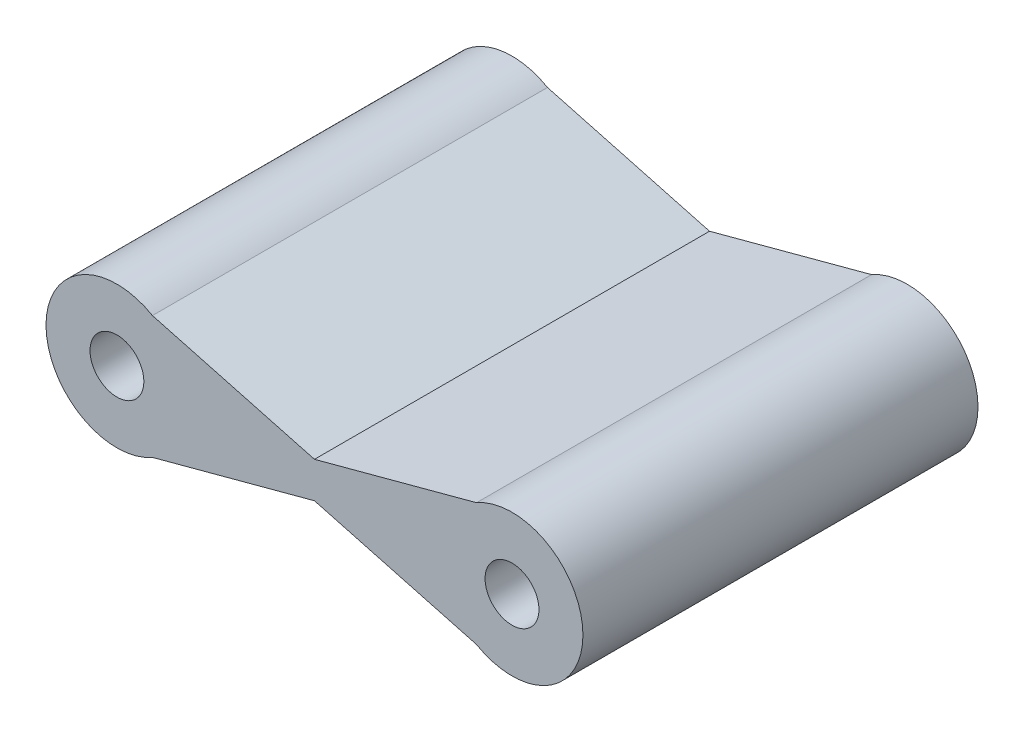
ISO-10303-21;
HEADER;
FILE_DESCRIPTION(('STEP AP214'),'2;1');
FILE_NAME('part.step','',(''),(''),'','','');
FILE_SCHEMA(('AUTOMOTIVE_DESIGN { 1 0 10303 214 1 1 1 1 }'));
ENDSEC;
DATA;
#1=APPLICATION_CONTEXT('core data for automotive mechanical design processes');
#2=APPLICATION_PROTOCOL_DEFINITION('international standard','automotive_design',2000,#1);
#3=PRODUCT_CONTEXT('',#1,'mechanical');
#4=PRODUCT('Part','Part','',(#3));
#5=PRODUCT_RELATED_PRODUCT_CATEGORY('part','',(#4));
#6=PRODUCT_DEFINITION_FORMATION('','',#4);
#7=PRODUCT_DEFINITION_CONTEXT('part definition',#1,'design');
#8=PRODUCT_DEFINITION('design','',#6,#7);
#9=PRODUCT_DEFINITION_SHAPE('','',#8);
#10=(LENGTH_UNIT() NAMED_UNIT(*) SI_UNIT(.MILLI.,.METRE.));
#11=(NAMED_UNIT(*) PLANE_ANGLE_UNIT() SI_UNIT($,.RADIAN.));
#12=(NAMED_UNIT(*) SI_UNIT($,.STERADIAN.) SOLID_ANGLE_UNIT());
#13=UNCERTAINTY_MEASURE_WITH_UNIT(LENGTH_MEASURE(1.E-05),#10,'distance_accuracy_value','');
#14=(GEOMETRIC_REPRESENTATION_CONTEXT(3) GLOBAL_UNCERTAINTY_ASSIGNED_CONTEXT((#13)) GLOBAL_UNIT_ASSIGNED_CONTEXT((#10,
#11,#12)) REPRESENTATION_CONTEXT('',''));
#15=CARTESIAN_POINT('',(0.,0.,0.));
#16=DIRECTION('',(0.,0.,1.));
#17=DIRECTION('',(1.,0.,0.));
#18=AXIS2_PLACEMENT_3D('',#15,#16,#17);
#19=CARTESIAN_POINT('',(0.36902719685434,1.37603361538906,11.));
#20=DIRECTION('',(-0.259028674037289,-0.965869632003452,0.));
#21=DIRECTION('',(0.965869632003452,-0.259028674037289,0.));
#22=AXIS2_PLACEMENT_3D('',#19,#20,#21);
#23=PLANE('',#22);
#24=DIRECTION('',(-0.965869632003452,0.25902867403729,0.));
#25=VECTOR('',#24,1.);
#26=CARTESIAN_POINT('',(0.36902719685434,1.37603361538906,0.));
#27=LINE('',#26,#25);
#28=CARTESIAN_POINT('',(10.0117576762206,-1.20997137680461,0.));
#29=VERTEX_POINT('',#28);
#30=CARTESIAN_POINT('',(5.5,0.,0.));
#31=VERTEX_POINT('',#30);
#32=EDGE_CURVE('E130',#29,#31,#27,.T.);
#33=ORIENTED_EDGE('',*,*,#32,.F.);
#34=DIRECTION('',(0.,0.,-1.));
#35=VECTOR('',#34,1.);
#36=CARTESIAN_POINT('',(10.0117576762206,-1.20997137680461,11.));
#37=LINE('',#36,#35);
#38=CARTESIAN_POINT('',(10.0117576762206,-1.20997137680461,11.));
#39=VERTEX_POINT('',#38);
#40=EDGE_CURVE('E11',#39,#29,#37,.T.);
#41=ORIENTED_EDGE('',*,*,#40,.F.);
#42=DIRECTION('',(-0.965869632003452,0.25902867403729,0.));
#43=VECTOR('',#42,1.);
#44=CARTESIAN_POINT('',(0.36902719685434,1.37603361538906,11.));
#45=LINE('',#44,#43);
#46=CARTESIAN_POINT('',(5.5,0.,11.));
#47=VERTEX_POINT('',#46);
#48=EDGE_CURVE('E190',#39,#47,#45,.T.);
#49=ORIENTED_EDGE('',*,*,#48,.T.);
#50=DIRECTION('',(0.,0.,-1.));
#51=VECTOR('',#50,1.);
#52=CARTESIAN_POINT('',(5.5,0.,11.));
#53=LINE('',#52,#51);
#54=EDGE_CURVE('E83',#47,#31,#53,.T.);
#55=ORIENTED_EDGE('',*,*,#54,.T.);
#56=EDGE_LOOP('',(#33,#41,#49,#55));
#57=FACE_BOUND('',#56,.T.);
#58=ADVANCED_FACE('F37',(#57),#23,.T.);
#59=CARTESIAN_POINT('',(11.,0.5,11.));
#60=DIRECTION('',(0.,0.,-1.));
#61=DIRECTION('',(-1.,0.,0.));
#62=AXIS2_PLACEMENT_3D('',#59,#60,#61);
#63=CYLINDRICAL_SURFACE('',#62,1.975);
#64=CARTESIAN_POINT('',(11.,0.5,0.));
#65=DIRECTION('',(0.,0.,1.));
#66=DIRECTION('',(1.,0.,0.));
#67=AXIS2_PLACEMENT_3D('',#64,#65,#66);
#68=CIRCLE('',#67,1.975);
#69=CARTESIAN_POINT('',(10.0117576762206,2.20997137680461,0.));
#70=VERTEX_POINT('',#69);
#71=EDGE_CURVE('E132',#29,#70,#68,.T.);
#72=ORIENTED_EDGE('',*,*,#71,.T.);
#73=DIRECTION('',(0.,0.,-1.));
#74=VECTOR('',#73,1.);
#75=CARTESIAN_POINT('',(10.0117576762206,2.20997137680461,11.));
#76=LINE('',#75,#74);
#77=CARTESIAN_POINT('',(10.0117576762206,2.20997137680461,11.));
#78=VERTEX_POINT('',#77);
#79=EDGE_CURVE('E46',#78,#70,#76,.T.);
#80=ORIENTED_EDGE('',*,*,#79,.F.);
#81=CARTESIAN_POINT('',(11.,0.5,11.));
#82=DIRECTION('',(0.,0.,1.));
#83=DIRECTION('',(1.,0.,0.));
#84=AXIS2_PLACEMENT_3D('',#81,#82,#83);
#85=CIRCLE('',#84,1.975);
#86=EDGE_CURVE('E119',#39,#78,#85,.T.);
#87=ORIENTED_EDGE('',*,*,#86,.F.);
#88=ORIENTED_EDGE('',*,*,#40,.T.);
#89=EDGE_LOOP('',(#72,#80,#87,#88));
#90=FACE_BOUND('',#89,.T.);
#91=ADVANCED_FACE('F154',(#90),#63,.T.);
#92=CARTESIAN_POINT('',(0.118839266783602,-0.443129469362582,11.));
#93=DIRECTION('',(-0.25902867403729,0.965869632003452,0.));
#94=DIRECTION('',(-0.965869632003452,-0.25902867403729,0.));
#95=AXIS2_PLACEMENT_3D('',#92,#93,#94);
#96=PLANE('',#95);
#97=DIRECTION('',(0.965869632003452,0.25902867403729,0.));
#98=VECTOR('',#97,1.);
#99=CARTESIAN_POINT('',(0.118839266783602,-0.443129469362582,0.));
#100=LINE('',#99,#98);
#101=CARTESIAN_POINT('',(5.5,0.999999999999999,0.));
#102=VERTEX_POINT('',#101);
#103=EDGE_CURVE('E135',#102,#70,#100,.T.);
#104=ORIENTED_EDGE('',*,*,#103,.F.);
#105=DIRECTION('',(0.,0.,-1.));
#106=VECTOR('',#105,1.);
#107=CARTESIAN_POINT('',(5.5,0.999999999999999,11.));
#108=LINE('',#107,#106);
#109=CARTESIAN_POINT('',(5.5,0.999999999999999,11.));
#110=VERTEX_POINT('',#109);
#111=EDGE_CURVE('E106',#110,#102,#108,.T.);
#112=ORIENTED_EDGE('',*,*,#111,.F.);
#113=DIRECTION('',(0.965869632003452,0.25902867403729,0.));
#114=VECTOR('',#113,1.);
#115=CARTESIAN_POINT('',(0.118839266783602,-0.443129469362582,11.));
#116=LINE('',#115,#114);
#117=EDGE_CURVE('E117',#110,#78,#116,.T.);
#118=ORIENTED_EDGE('',*,*,#117,.T.);
#119=ORIENTED_EDGE('',*,*,#79,.T.);
#120=EDGE_LOOP('',(#104,#112,#118,#119));
#121=FACE_BOUND('',#120,.T.);
#122=ADVANCED_FACE('F151',(#121),#96,.T.);
#123=CARTESIAN_POINT('',(0.619215126925079,2.30893776141555,11.));
#124=DIRECTION('',(0.25902867403729,0.965869632003452,0.));
#125=DIRECTION('',(-0.965869632003452,0.25902867403729,0.));
#126=AXIS2_PLACEMENT_3D('',#123,#124,#125);
#127=PLANE('',#126);
#128=DIRECTION('',(0.965869632003452,-0.25902867403729,0.));
#129=VECTOR('',#128,1.);
#130=CARTESIAN_POINT('',(0.619215126925079,2.30893776141555,0.));
#131=LINE('',#130,#129);
#132=CARTESIAN_POINT('',(0.98824232377942,2.20997137680461,0.));
#133=VERTEX_POINT('',#132);
#134=EDGE_CURVE('E103',#133,#102,#131,.T.);
#135=ORIENTED_EDGE('',*,*,#134,.F.);
#136=DIRECTION('',(0.,0.,-1.));
#137=VECTOR('',#136,1.);
#138=CARTESIAN_POINT('',(0.98824232377942,2.20997137680461,11.));
#139=LINE('',#138,#137);
#140=CARTESIAN_POINT('',(0.98824232377942,2.20997137680461,11.));
#141=VERTEX_POINT('',#140);
#142=EDGE_CURVE('E97',#141,#133,#139,.T.);
#143=ORIENTED_EDGE('',*,*,#142,.F.);
#144=DIRECTION('',(0.965869632003452,-0.25902867403729,0.));
#145=VECTOR('',#144,1.);
#146=CARTESIAN_POINT('',(0.619215126925079,2.30893776141555,11.));
#147=LINE('',#146,#145);
#148=EDGE_CURVE('E101',#141,#110,#147,.T.);
#149=ORIENTED_EDGE('',*,*,#148,.T.);
#150=ORIENTED_EDGE('',*,*,#111,.T.);
#151=EDGE_LOOP('',(#135,#143,#149,#150));
#152=FACE_BOUND('',#151,.T.);
#153=ADVANCED_FACE('F99',(#152),#127,.T.);
#154=CARTESIAN_POINT('',(0.,0.5,11.));
#155=DIRECTION('',(0.,0.,-1.));
#156=DIRECTION('',(-1.,0.,0.));
#157=AXIS2_PLACEMENT_3D('',#154,#155,#156);
#158=CYLINDRICAL_SURFACE('',#157,1.975);
#159=CARTESIAN_POINT('',(0.,0.5,0.));
#160=DIRECTION('',(0.,0.,1.));
#161=DIRECTION('',(1.,0.,0.));
#162=AXIS2_PLACEMENT_3D('',#159,#160,#161);
#163=CIRCLE('',#162,1.975);
#164=CARTESIAN_POINT('',(0.988242323779417,-1.20997137680461,0.));
#165=VERTEX_POINT('',#164);
#166=EDGE_CURVE('E139',#133,#165,#163,.T.);
#167=ORIENTED_EDGE('',*,*,#166,.T.);
#168=DIRECTION('',(0.,0.,-1.));
#169=VECTOR('',#168,1.);
#170=CARTESIAN_POINT('',(0.988242323779417,-1.20997137680461,11.));
#171=LINE('',#170,#169);
#172=CARTESIAN_POINT('',(0.988242323779417,-1.20997137680461,11.));
#173=VERTEX_POINT('',#172);
#174=EDGE_CURVE('E107',#173,#165,#171,.T.);
#175=ORIENTED_EDGE('',*,*,#174,.F.);
#176=CARTESIAN_POINT('',(0.,0.5,11.));
#177=DIRECTION('',(0.,0.,1.));
#178=DIRECTION('',(1.,0.,0.));
#179=AXIS2_PLACEMENT_3D('',#176,#177,#178);
#180=CIRCLE('',#179,1.975);
#181=EDGE_CURVE('E110',#141,#173,#180,.T.);
#182=ORIENTED_EDGE('',*,*,#181,.F.);
#183=ORIENTED_EDGE('',*,*,#142,.T.);
#184=EDGE_LOOP('',(#167,#175,#182,#183));
#185=FACE_BOUND('',#184,.T.);
#186=ADVANCED_FACE('F111',(#185),#158,.T.);
#187=CARTESIAN_POINT('',(0.36902719685434,-1.37603361538906,11.));
#188=DIRECTION('',(-0.259028674037289,0.965869632003452,0.));
#189=DIRECTION('',(-0.965869632003452,-0.259028674037289,0.));
#190=AXIS2_PLACEMENT_3D('',#187,#188,#189);
#191=PLANE('',#190);
#192=DIRECTION('',(0.965869632003452,0.259028674037289,0.));
#193=VECTOR('',#192,1.);
#194=CARTESIAN_POINT('',(0.36902719685434,-1.37603361538906,0.));
#195=LINE('',#194,#193);
#196=EDGE_CURVE('E76',#165,#31,#195,.T.);
#197=ORIENTED_EDGE('',*,*,#196,.T.);
#198=ORIENTED_EDGE('',*,*,#54,.F.);
#199=DIRECTION('',(0.965869632003452,0.259028674037289,0.));
#200=VECTOR('',#199,1.);
#201=CARTESIAN_POINT('',(0.36902719685434,-1.37603361538906,11.));
#202=LINE('',#201,#200);
#203=EDGE_CURVE('E54',#173,#47,#202,.T.);
#204=ORIENTED_EDGE('',*,*,#203,.F.);
#205=ORIENTED_EDGE('',*,*,#174,.T.);
#206=EDGE_LOOP('',(#197,#198,#204,#205));
#207=FACE_BOUND('',#206,.T.);
#208=ADVANCED_FACE('F172',(#207),#191,.F.);
#209=CARTESIAN_POINT('',(11.,0.5,11.));
#210=DIRECTION('',(0.,0.,-1.));
#211=DIRECTION('',(-1.,0.,0.));
#212=AXIS2_PLACEMENT_3D('',#209,#210,#211);
#213=CYLINDRICAL_SURFACE('',#212,0.75);
#214=CARTESIAN_POINT('',(11.,0.5,11.));
#215=DIRECTION('',(0.,0.,1.));
#216=DIRECTION('',(1.,0.,0.));
#217=AXIS2_PLACEMENT_3D('',#214,#215,#216);
#218=CIRCLE('',#217,0.75);
#219=CARTESIAN_POINT('',(11.75,0.5,11.));
#220=VERTEX_POINT('',#219);
#221=EDGE_CURVE('E145',#220,#220,#218,.T.);
#222=ORIENTED_EDGE('',*,*,#221,.T.);
#223=EDGE_LOOP('',(#222));
#224=FACE_BOUND('',#223,.T.);
#225=CARTESIAN_POINT('',(11.,0.5,0.));
#226=DIRECTION('',(0.,0.,1.));
#227=DIRECTION('',(1.,0.,0.));
#228=AXIS2_PLACEMENT_3D('',#225,#226,#227);
#229=CIRCLE('',#228,0.75);
#230=CARTESIAN_POINT('',(11.75,0.5,0.));
#231=VERTEX_POINT('',#230);
#232=EDGE_CURVE('E127',#231,#231,#229,.T.);
#233=ORIENTED_EDGE('',*,*,#232,.F.);
#234=EDGE_LOOP('',(#233));
#235=FACE_BOUND('',#234,.T.);
#236=ADVANCED_FACE('F39',(#224,#235),#213,.F.);
#237=CARTESIAN_POINT('',(0.,0.5,11.));
#238=DIRECTION('',(0.,0.,-1.));
#239=DIRECTION('',(-1.,0.,0.));
#240=AXIS2_PLACEMENT_3D('',#237,#238,#239);
#241=CYLINDRICAL_SURFACE('',#240,0.75);
#242=CARTESIAN_POINT('',(0.,0.5,11.));
#243=DIRECTION('',(0.,0.,1.));
#244=DIRECTION('',(1.,0.,0.));
#245=AXIS2_PLACEMENT_3D('',#242,#243,#244);
#246=CIRCLE('',#245,0.75);
#247=CARTESIAN_POINT('',(0.75,0.5,11.));
#248=VERTEX_POINT('',#247);
#249=EDGE_CURVE('E124',#248,#248,#246,.T.);
#250=ORIENTED_EDGE('',*,*,#249,.T.);
#251=EDGE_LOOP('',(#250));
#252=FACE_BOUND('',#251,.T.);
#253=CARTESIAN_POINT('',(0.,0.5,0.));
#254=DIRECTION('',(0.,0.,1.));
#255=DIRECTION('',(1.,0.,0.));
#256=AXIS2_PLACEMENT_3D('',#253,#254,#255);
#257=CIRCLE('',#256,0.75);
#258=CARTESIAN_POINT('',(0.75,0.5,0.));
#259=VERTEX_POINT('',#258);
#260=EDGE_CURVE('E142',#259,#259,#257,.T.);
#261=ORIENTED_EDGE('',*,*,#260,.F.);
#262=EDGE_LOOP('',(#261));
#263=FACE_BOUND('',#262,.T.);
#264=ADVANCED_FACE('F162',(#252,#263),#241,.F.);
#265=CARTESIAN_POINT('',(0.,0.,11.));
#266=DIRECTION('',(0.,0.,1.));
#267=DIRECTION('',(1.,0.,0.));
#268=AXIS2_PLACEMENT_3D('',#265,#266,#267);
#269=PLANE('',#268);
#270=ORIENTED_EDGE('',*,*,#221,.F.);
#271=EDGE_LOOP('',(#270));
#272=FACE_BOUND('',#271,.T.);
#273=ORIENTED_EDGE('',*,*,#48,.F.);
#274=ORIENTED_EDGE('',*,*,#86,.T.);
#275=ORIENTED_EDGE('',*,*,#117,.F.);
#276=ORIENTED_EDGE('',*,*,#148,.F.);
#277=ORIENTED_EDGE('',*,*,#181,.T.);
#278=ORIENTED_EDGE('',*,*,#203,.T.);
#279=EDGE_LOOP('',(#273,#274,#275,#276,#277,#278));
#280=FACE_BOUND('',#279,.T.);
#281=ORIENTED_EDGE('',*,*,#249,.F.);
#282=EDGE_LOOP('',(#281));
#283=FACE_BOUND('',#282,.T.);
#284=ADVANCED_FACE('F114',(#272,#280,#283),#269,.T.);
#285=CARTESIAN_POINT('',(0.,0.,0.));
#286=DIRECTION('',(0.,0.,1.));
#287=DIRECTION('',(1.,0.,0.));
#288=AXIS2_PLACEMENT_3D('',#285,#286,#287);
#289=PLANE('',#288);
#290=ORIENTED_EDGE('',*,*,#232,.T.);
#291=EDGE_LOOP('',(#290));
#292=FACE_BOUND('',#291,.T.);
#293=ORIENTED_EDGE('',*,*,#32,.T.);
#294=ORIENTED_EDGE('',*,*,#196,.F.);
#295=ORIENTED_EDGE('',*,*,#166,.F.);
#296=ORIENTED_EDGE('',*,*,#134,.T.);
#297=ORIENTED_EDGE('',*,*,#103,.T.);
#298=ORIENTED_EDGE('',*,*,#71,.F.);
#299=EDGE_LOOP('',(#293,#294,#295,#296,#297,#298));
#300=FACE_BOUND('',#299,.T.);
#301=ORIENTED_EDGE('',*,*,#260,.T.);
#302=EDGE_LOOP('',(#301));
#303=FACE_BOUND('',#302,.T.);
#304=ADVANCED_FACE('F155',(#292,#300,#303),#289,.F.);
#305=CLOSED_SHELL('',(#58,#91,#122,#153,#186,#208,#236,#264,#284,#304));
#306=MANIFOLD_SOLID_BREP('B2',#305);
#307=ADVANCED_BREP_SHAPE_REPRESENTATION('',(#18,#306),#14);
#308=SHAPE_DEFINITION_REPRESENTATION(#9,#307);
ENDSEC;
END-ISO-10303-21;
